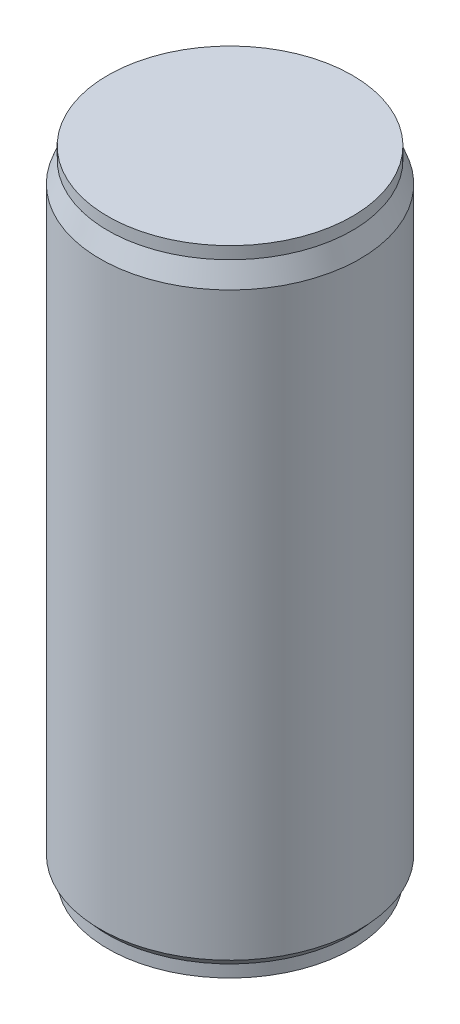
ISO-10303-21;
HEADER;
FILE_DESCRIPTION(('STEP AP214'),'2;1');
FILE_NAME('part.step','',(''),(''),'','','');
FILE_SCHEMA(('AUTOMOTIVE_DESIGN { 1 0 10303 214 1 1 1 1 }'));
ENDSEC;
DATA;
#1=APPLICATION_CONTEXT('core data for automotive mechanical design processes');
#2=APPLICATION_PROTOCOL_DEFINITION('international standard','automotive_design',2000,#1);
#3=PRODUCT_CONTEXT('',#1,'mechanical');
#4=PRODUCT('Part','Part','',(#3));
#5=PRODUCT_RELATED_PRODUCT_CATEGORY('part','',(#4));
#6=PRODUCT_DEFINITION_FORMATION('','',#4);
#7=PRODUCT_DEFINITION_CONTEXT('part definition',#1,'design');
#8=PRODUCT_DEFINITION('design','',#6,#7);
#9=PRODUCT_DEFINITION_SHAPE('','',#8);
#10=(LENGTH_UNIT() NAMED_UNIT(*) SI_UNIT(.MILLI.,.METRE.));
#11=(NAMED_UNIT(*) PLANE_ANGLE_UNIT() SI_UNIT($,.RADIAN.));
#12=(NAMED_UNIT(*) SI_UNIT($,.STERADIAN.) SOLID_ANGLE_UNIT());
#13=UNCERTAINTY_MEASURE_WITH_UNIT(LENGTH_MEASURE(1.E-05),#10,'distance_accuracy_value','');
#14=(GEOMETRIC_REPRESENTATION_CONTEXT(3) GLOBAL_UNCERTAINTY_ASSIGNED_CONTEXT((#13)) GLOBAL_UNIT_ASSIGNED_CONTEXT((#10,
#11,#12)) REPRESENTATION_CONTEXT('',''));
#15=CARTESIAN_POINT('',(0.,0.,0.));
#16=DIRECTION('',(0.,0.,1.));
#17=DIRECTION('',(1.,0.,0.));
#18=AXIS2_PLACEMENT_3D('',#15,#16,#17);
#19=CARTESIAN_POINT('',(25.4,0.,0.));
#20=DIRECTION('',(0.,-1.,0.));
#21=DIRECTION('',(0.,0.,-1.));
#22=AXIS2_PLACEMENT_3D('',#19,#20,#21);
#23=PLANE('',#22);
#24=CARTESIAN_POINT('',(0.,0.,0.));
#25=DIRECTION('',(0.,-1.,0.));
#26=DIRECTION('',(0.,0.,-1.));
#27=AXIS2_PLACEMENT_3D('',#24,#25,#26);
#28=CIRCLE('',#27,25.4);
#29=CARTESIAN_POINT('',(0.,0.,-25.4));
#30=VERTEX_POINT('',#29);
#31=EDGE_CURVE('E53',#30,#30,#28,.T.);
#32=ORIENTED_EDGE('',*,*,#31,.T.);
#33=EDGE_LOOP('',(#32));
#34=FACE_BOUND('',#33,.T.);
#35=ADVANCED_FACE('F31',(#34),#23,.T.);
#36=CARTESIAN_POINT('',(0.,131.7625,0.));
#37=DIRECTION('',(0.,1.,0.));
#38=DIRECTION('',(0.,0.,1.));
#39=AXIS2_PLACEMENT_3D('',#36,#37,#38);
#40=PLANE('',#39);
#41=CARTESIAN_POINT('',(0.,131.7625,0.));
#42=DIRECTION('',(0.,-1.,0.));
#43=DIRECTION('',(0.,0.,-1.));
#44=AXIS2_PLACEMENT_3D('',#41,#42,#43);
#45=CIRCLE('',#44,25.4);
#46=CARTESIAN_POINT('',(0.,131.7625,-25.4));
#47=VERTEX_POINT('',#46);
#48=EDGE_CURVE('E10',#47,#47,#45,.T.);
#49=ORIENTED_EDGE('',*,*,#48,.F.);
#50=EDGE_LOOP('',(#49));
#51=FACE_BOUND('',#50,.T.);
#52=ADVANCED_FACE('F70',(#51),#40,.T.);
#53=CARTESIAN_POINT('',(0.,0.,0.));
#54=DIRECTION('',(0.,-1.,0.));
#55=DIRECTION('',(0.,0.,-1.));
#56=AXIS2_PLACEMENT_3D('',#53,#54,#55);
#57=CYLINDRICAL_SURFACE('',#56,25.4);
#58=ORIENTED_EDGE('',*,*,#48,.T.);
#59=EDGE_LOOP('',(#58));
#60=FACE_BOUND('',#59,.T.);
#61=CARTESIAN_POINT('',(0.,129.2225,0.));
#62=DIRECTION('',(0.,-1.,0.));
#63=DIRECTION('',(0.,0.,-1.));
#64=AXIS2_PLACEMENT_3D('',#61,#62,#63);
#65=CIRCLE('',#64,25.4);
#66=CARTESIAN_POINT('',(0.,129.2225,-25.4));
#67=VERTEX_POINT('',#66);
#68=EDGE_CURVE('E37',#67,#67,#65,.T.);
#69=ORIENTED_EDGE('',*,*,#68,.F.);
#70=EDGE_LOOP('',(#69));
#71=FACE_BOUND('',#70,.T.);
#72=ADVANCED_FACE('F74',(#60,#71),#57,.T.);
#73=CARTESIAN_POINT('',(0.,124.9045,0.));
#74=DIRECTION('',(0.,-1.,0.));
#75=DIRECTION('',(0.,0.,-1.));
#76=AXIS2_PLACEMENT_3D('',#73,#74,#75);
#77=CONICAL_SURFACE('',#76,26.9875,0.352308724674143);
#78=ORIENTED_EDGE('',*,*,#68,.T.);
#79=EDGE_LOOP('',(#78));
#80=FACE_BOUND('',#79,.T.);
#81=CARTESIAN_POINT('',(0.,124.9045,0.));
#82=DIRECTION('',(0.,-1.,0.));
#83=DIRECTION('',(0.,0.,-1.));
#84=AXIS2_PLACEMENT_3D('',#81,#82,#83);
#85=CIRCLE('',#84,26.9875);
#86=CARTESIAN_POINT('',(0.,124.9045,-26.9875));
#87=VERTEX_POINT('',#86);
#88=EDGE_CURVE('E41',#87,#87,#85,.T.);
#89=ORIENTED_EDGE('',*,*,#88,.F.);
#90=EDGE_LOOP('',(#89));
#91=FACE_BOUND('',#90,.T.);
#92=ADVANCED_FACE('F79',(#80,#91),#77,.T.);
#93=CARTESIAN_POINT('',(0.,0.,0.));
#94=DIRECTION('',(0.,-1.,0.));
#95=DIRECTION('',(0.,0.,-1.));
#96=AXIS2_PLACEMENT_3D('',#93,#94,#95);
#97=CYLINDRICAL_SURFACE('',#96,26.9875);
#98=ORIENTED_EDGE('',*,*,#88,.T.);
#99=EDGE_LOOP('',(#98));
#100=FACE_BOUND('',#99,.T.);
#101=CARTESIAN_POINT('',(0.,4.318,0.));
#102=DIRECTION('',(0.,-1.,0.));
#103=DIRECTION('',(0.,0.,-1.));
#104=AXIS2_PLACEMENT_3D('',#101,#102,#103);
#105=CIRCLE('',#104,26.9875);
#106=CARTESIAN_POINT('',(0.,4.318,-26.9875));
#107=VERTEX_POINT('',#106);
#108=EDGE_CURVE('E45',#107,#107,#105,.T.);
#109=ORIENTED_EDGE('',*,*,#108,.F.);
#110=EDGE_LOOP('',(#109));
#111=FACE_BOUND('',#110,.T.);
#112=ADVANCED_FACE('F66',(#100,#111),#97,.T.);
#113=CARTESIAN_POINT('',(0.,2.54,0.));
#114=DIRECTION('',(0.,1.,0.));
#115=DIRECTION('',(0.,0.,1.));
#116=AXIS2_PLACEMENT_3D('',#113,#114,#115);
#117=CONICAL_SURFACE('',#116,25.4,0.728854726452635);
#118=ORIENTED_EDGE('',*,*,#108,.T.);
#119=EDGE_LOOP('',(#118));
#120=FACE_BOUND('',#119,.T.);
#121=CARTESIAN_POINT('',(0.,2.54,0.));
#122=DIRECTION('',(0.,-1.,0.));
#123=DIRECTION('',(0.,0.,-1.));
#124=AXIS2_PLACEMENT_3D('',#121,#122,#123);
#125=CIRCLE('',#124,25.4);
#126=CARTESIAN_POINT('',(0.,2.54,-25.4));
#127=VERTEX_POINT('',#126);
#128=EDGE_CURVE('E50',#127,#127,#125,.T.);
#129=ORIENTED_EDGE('',*,*,#128,.F.);
#130=EDGE_LOOP('',(#129));
#131=FACE_BOUND('',#130,.T.);
#132=ADVANCED_FACE('F60',(#120,#131),#117,.T.);
#133=CARTESIAN_POINT('',(0.,0.,0.));
#134=DIRECTION('',(0.,-1.,0.));
#135=DIRECTION('',(0.,0.,-1.));
#136=AXIS2_PLACEMENT_3D('',#133,#134,#135);
#137=CYLINDRICAL_SURFACE('',#136,25.4);
#138=ORIENTED_EDGE('',*,*,#128,.T.);
#139=EDGE_LOOP('',(#138));
#140=FACE_BOUND('',#139,.T.);
#141=ORIENTED_EDGE('',*,*,#31,.F.);
#142=EDGE_LOOP('',(#141));
#143=FACE_BOUND('',#142,.T.);
#144=ADVANCED_FACE('F58',(#140,#143),#137,.T.);
#145=CLOSED_SHELL('',(#35,#52,#72,#92,#112,#132,#144));
#146=MANIFOLD_SOLID_BREP('B2',#145);
#147=ADVANCED_BREP_SHAPE_REPRESENTATION('',(#18,#146),#14);
#148=SHAPE_DEFINITION_REPRESENTATION(#9,#147);
ENDSEC;
END-ISO-10303-21;
